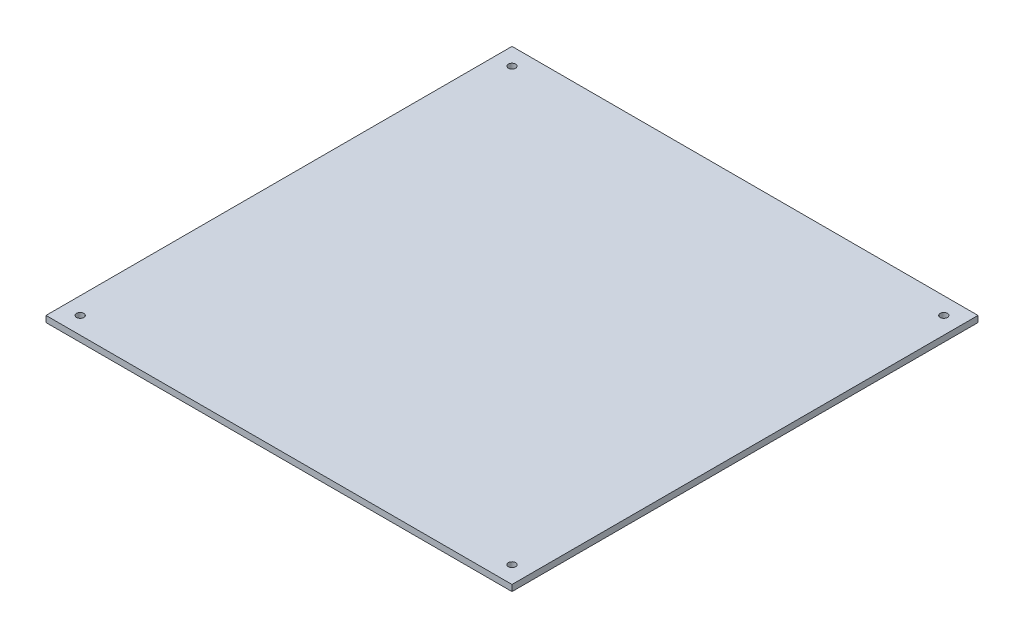
ISO-10303-21;
HEADER;
FILE_DESCRIPTION(('STEP AP214'),'2;1');
FILE_NAME('part.step','',(''),(''),'','','');
FILE_SCHEMA(('AUTOMOTIVE_DESIGN { 1 0 10303 214 1 1 1 1 }'));
ENDSEC;
DATA;
#1=APPLICATION_CONTEXT('core data for automotive mechanical design processes');
#2=APPLICATION_PROTOCOL_DEFINITION('international standard','automotive_design',2000,#1);
#3=PRODUCT_CONTEXT('',#1,'mechanical');
#4=PRODUCT('Part','Part','',(#3));
#5=PRODUCT_RELATED_PRODUCT_CATEGORY('part','',(#4));
#6=PRODUCT_DEFINITION_FORMATION('','',#4);
#7=PRODUCT_DEFINITION_CONTEXT('part definition',#1,'design');
#8=PRODUCT_DEFINITION('design','',#6,#7);
#9=PRODUCT_DEFINITION_SHAPE('','',#8);
#10=(LENGTH_UNIT() NAMED_UNIT(*) SI_UNIT(.MILLI.,.METRE.));
#11=(NAMED_UNIT(*) PLANE_ANGLE_UNIT() SI_UNIT($,.RADIAN.));
#12=(NAMED_UNIT(*) SI_UNIT($,.STERADIAN.) SOLID_ANGLE_UNIT());
#13=UNCERTAINTY_MEASURE_WITH_UNIT(LENGTH_MEASURE(1.E-05),#10,'distance_accuracy_value','');
#14=(GEOMETRIC_REPRESENTATION_CONTEXT(3) GLOBAL_UNCERTAINTY_ASSIGNED_CONTEXT((#13)) GLOBAL_UNIT_ASSIGNED_CONTEXT((#10,
#11,#12)) REPRESENTATION_CONTEXT('',''));
#15=CARTESIAN_POINT('',(0.,0.,0.));
#16=DIRECTION('',(0.,0.,1.));
#17=DIRECTION('',(1.,0.,0.));
#18=AXIS2_PLACEMENT_3D('',#15,#16,#17);
#19=CARTESIAN_POINT('',(0.,3.,0.));
#20=DIRECTION('',(1.,0.,0.));
#21=DIRECTION('',(0.,0.,-1.));
#22=AXIS2_PLACEMENT_3D('',#19,#20,#21);
#23=PLANE('',#22);
#24=DIRECTION('',(0.,0.,1.));
#25=VECTOR('',#24,1.);
#26=CARTESIAN_POINT('',(0.,0.,0.));
#27=LINE('',#26,#25);
#28=CARTESIAN_POINT('',(0.,0.,-225.));
#29=VERTEX_POINT('',#28);
#30=CARTESIAN_POINT('',(0.,0.,0.));
#31=VERTEX_POINT('',#30);
#32=EDGE_CURVE('E100',#29,#31,#27,.T.);
#33=ORIENTED_EDGE('',*,*,#32,.T.);
#34=DIRECTION('',(0.,-1.,0.));
#35=VECTOR('',#34,1.);
#36=CARTESIAN_POINT('',(0.,3.,0.));
#37=LINE('',#36,#35);
#38=CARTESIAN_POINT('',(0.,3.,0.));
#39=VERTEX_POINT('',#38);
#40=EDGE_CURVE('E11',#39,#31,#37,.T.);
#41=ORIENTED_EDGE('',*,*,#40,.F.);
#42=DIRECTION('',(0.,0.,1.));
#43=VECTOR('',#42,1.);
#44=CARTESIAN_POINT('',(0.,3.,0.));
#45=LINE('',#44,#43);
#46=CARTESIAN_POINT('',(0.,3.,-225.));
#47=VERTEX_POINT('',#46);
#48=EDGE_CURVE('E88',#47,#39,#45,.T.);
#49=ORIENTED_EDGE('',*,*,#48,.F.);
#50=DIRECTION('',(0.,-1.,0.));
#51=VECTOR('',#50,1.);
#52=CARTESIAN_POINT('',(0.,3.,-225.));
#53=LINE('',#52,#51);
#54=EDGE_CURVE('E96',#47,#29,#53,.T.);
#55=ORIENTED_EDGE('',*,*,#54,.T.);
#56=EDGE_LOOP('',(#33,#41,#49,#55));
#57=FACE_BOUND('',#56,.T.);
#58=ADVANCED_FACE('F37',(#57),#23,.F.);
#59=CARTESIAN_POINT('',(0.,3.,0.));
#60=DIRECTION('',(0.,0.,-1.));
#61=DIRECTION('',(-1.,0.,0.));
#62=AXIS2_PLACEMENT_3D('',#59,#60,#61);
#63=PLANE('',#62);
#64=DIRECTION('',(1.,0.,0.));
#65=VECTOR('',#64,1.);
#66=CARTESIAN_POINT('',(0.,0.,0.));
#67=LINE('',#66,#65);
#68=CARTESIAN_POINT('',(225.,0.,0.));
#69=VERTEX_POINT('',#68);
#70=EDGE_CURVE('E92',#31,#69,#67,.T.);
#71=ORIENTED_EDGE('',*,*,#70,.T.);
#72=DIRECTION('',(0.,-1.,0.));
#73=VECTOR('',#72,1.);
#74=CARTESIAN_POINT('',(225.,3.,0.));
#75=LINE('',#74,#73);
#76=CARTESIAN_POINT('',(225.,3.,0.));
#77=VERTEX_POINT('',#76);
#78=EDGE_CURVE('E45',#77,#69,#75,.T.);
#79=ORIENTED_EDGE('',*,*,#78,.F.);
#80=DIRECTION('',(1.,0.,0.));
#81=VECTOR('',#80,1.);
#82=CARTESIAN_POINT('',(0.,3.,0.));
#83=LINE('',#82,#81);
#84=EDGE_CURVE('E83',#39,#77,#83,.T.);
#85=ORIENTED_EDGE('',*,*,#84,.F.);
#86=ORIENTED_EDGE('',*,*,#40,.T.);
#87=EDGE_LOOP('',(#71,#79,#85,#86));
#88=FACE_BOUND('',#87,.T.);
#89=ADVANCED_FACE('F91',(#88),#63,.F.);
#90=CARTESIAN_POINT('',(225.,3.,0.));
#91=DIRECTION('',(-1.,0.,0.));
#92=DIRECTION('',(0.,0.,1.));
#93=AXIS2_PLACEMENT_3D('',#90,#91,#92);
#94=PLANE('',#93);
#95=DIRECTION('',(0.,0.,-1.));
#96=VECTOR('',#95,1.);
#97=CARTESIAN_POINT('',(225.,0.,0.));
#98=LINE('',#97,#96);
#99=CARTESIAN_POINT('',(225.,0.,-225.));
#100=VERTEX_POINT('',#99);
#101=EDGE_CURVE('E70',#69,#100,#98,.T.);
#102=ORIENTED_EDGE('',*,*,#101,.T.);
#103=DIRECTION('',(0.,-1.,0.));
#104=VECTOR('',#103,1.);
#105=CARTESIAN_POINT('',(225.,3.,-225.));
#106=LINE('',#105,#104);
#107=CARTESIAN_POINT('',(225.,3.,-225.));
#108=VERTEX_POINT('',#107);
#109=EDGE_CURVE('E93',#108,#100,#106,.T.);
#110=ORIENTED_EDGE('',*,*,#109,.F.);
#111=DIRECTION('',(0.,0.,-1.));
#112=VECTOR('',#111,1.);
#113=CARTESIAN_POINT('',(225.,3.,0.));
#114=LINE('',#113,#112);
#115=EDGE_CURVE('E86',#77,#108,#114,.T.);
#116=ORIENTED_EDGE('',*,*,#115,.F.);
#117=ORIENTED_EDGE('',*,*,#78,.T.);
#118=EDGE_LOOP('',(#102,#110,#116,#117));
#119=FACE_BOUND('',#118,.T.);
#120=ADVANCED_FACE('F94',(#119),#94,.F.);
#121=CARTESIAN_POINT('',(0.,3.,-225.));
#122=DIRECTION('',(0.,0.,1.));
#123=DIRECTION('',(1.,0.,0.));
#124=AXIS2_PLACEMENT_3D('',#121,#122,#123);
#125=PLANE('',#124);
#126=DIRECTION('',(-1.,0.,0.));
#127=VECTOR('',#126,1.);
#128=CARTESIAN_POINT('',(0.,0.,-225.));
#129=LINE('',#128,#127);
#130=EDGE_CURVE('E76',#100,#29,#129,.T.);
#131=ORIENTED_EDGE('',*,*,#130,.T.);
#132=ORIENTED_EDGE('',*,*,#54,.F.);
#133=DIRECTION('',(-1.,0.,0.));
#134=VECTOR('',#133,1.);
#135=CARTESIAN_POINT('',(0.,3.,-225.));
#136=LINE('',#135,#134);
#137=EDGE_CURVE('E53',#108,#47,#136,.T.);
#138=ORIENTED_EDGE('',*,*,#137,.F.);
#139=ORIENTED_EDGE('',*,*,#109,.T.);
#140=EDGE_LOOP('',(#131,#132,#138,#139));
#141=FACE_BOUND('',#140,.T.);
#142=ADVANCED_FACE('F108',(#141),#125,.F.);
#143=CARTESIAN_POINT('',(0.,3.,0.));
#144=DIRECTION('',(0.,-1.,0.));
#145=DIRECTION('',(0.,0.,-1.));
#146=AXIS2_PLACEMENT_3D('',#143,#144,#145);
#147=PLANE('',#146);
#148=CARTESIAN_POINT('',(8.25999999999999,3.,-216.74));
#149=DIRECTION('',(0.,1.,0.));
#150=DIRECTION('',(0.,0.,-1.));
#151=AXIS2_PLACEMENT_3D('',#148,#149,#150);
#152=CIRCLE('',#151,1.75000000000001);
#153=CARTESIAN_POINT('',(8.25999999999999,3.,-218.49));
#154=VERTEX_POINT('',#153);
#155=EDGE_CURVE('E127',#154,#154,#152,.T.);
#156=ORIENTED_EDGE('',*,*,#155,.F.);
#157=EDGE_LOOP('',(#156));
#158=FACE_BOUND('',#157,.T.);
#159=CARTESIAN_POINT('',(216.74,3.,-8.26000000000002));
#160=DIRECTION('',(0.,1.,0.));
#161=DIRECTION('',(0.,0.,-1.));
#162=AXIS2_PLACEMENT_3D('',#159,#160,#161);
#163=CIRCLE('',#162,1.75000000000001);
#164=CARTESIAN_POINT('',(216.74,3.,-10.01));
#165=VERTEX_POINT('',#164);
#166=EDGE_CURVE('E120',#165,#165,#163,.T.);
#167=ORIENTED_EDGE('',*,*,#166,.F.);
#168=EDGE_LOOP('',(#167));
#169=FACE_BOUND('',#168,.T.);
#170=CARTESIAN_POINT('',(8.26000000000002,3.,-8.25999999999996));
#171=DIRECTION('',(0.,1.,0.));
#172=DIRECTION('',(0.,0.,1.));
#173=AXIS2_PLACEMENT_3D('',#170,#171,#172);
#174=CIRCLE('',#173,1.75000000000001);
#175=CARTESIAN_POINT('',(8.26000000000002,3.,-6.50999999999995));
#176=VERTEX_POINT('',#175);
#177=EDGE_CURVE('E132',#176,#176,#174,.T.);
#178=ORIENTED_EDGE('',*,*,#177,.F.);
#179=EDGE_LOOP('',(#178));
#180=FACE_BOUND('',#179,.T.);
#181=CARTESIAN_POINT('',(216.74,3.,-216.74));
#182=DIRECTION('',(0.,1.,0.));
#183=DIRECTION('',(0.,0.,1.));
#184=AXIS2_PLACEMENT_3D('',#181,#182,#183);
#185=CIRCLE('',#184,1.75000000000001);
#186=CARTESIAN_POINT('',(216.74,3.,-214.99));
#187=VERTEX_POINT('',#186);
#188=EDGE_CURVE('E114',#187,#187,#185,.T.);
#189=ORIENTED_EDGE('',*,*,#188,.F.);
#190=EDGE_LOOP('',(#189));
#191=FACE_BOUND('',#190,.T.);
#192=ORIENTED_EDGE('',*,*,#48,.T.);
#193=ORIENTED_EDGE('',*,*,#84,.T.);
#194=ORIENTED_EDGE('',*,*,#115,.T.);
#195=ORIENTED_EDGE('',*,*,#137,.T.);
#196=EDGE_LOOP('',(#192,#193,#194,#195));
#197=FACE_BOUND('',#196,.T.);
#198=ADVANCED_FACE('F84',(#158,#169,#180,#191,#197),#147,.F.);
#199=CARTESIAN_POINT('',(0.,0.,0.));
#200=DIRECTION('',(0.,-1.,0.));
#201=DIRECTION('',(0.,0.,-1.));
#202=AXIS2_PLACEMENT_3D('',#199,#200,#201);
#203=PLANE('',#202);
#204=CARTESIAN_POINT('',(8.25999999999999,0.,-216.74));
#205=DIRECTION('',(0.,1.,0.));
#206=DIRECTION('',(0.,0.,-1.));
#207=AXIS2_PLACEMENT_3D('',#204,#205,#206);
#208=CIRCLE('',#207,1.75000000000001);
#209=CARTESIAN_POINT('',(8.25999999999999,0.,-218.49));
#210=VERTEX_POINT('',#209);
#211=EDGE_CURVE('E117',#210,#210,#208,.T.);
#212=ORIENTED_EDGE('',*,*,#211,.T.);
#213=EDGE_LOOP('',(#212));
#214=FACE_BOUND('',#213,.T.);
#215=CARTESIAN_POINT('',(216.74,0.,-8.26000000000002));
#216=DIRECTION('',(0.,1.,0.));
#217=DIRECTION('',(0.,0.,-1.));
#218=AXIS2_PLACEMENT_3D('',#215,#216,#217);
#219=CIRCLE('',#218,1.75000000000001);
#220=CARTESIAN_POINT('',(216.74,0.,-10.01));
#221=VERTEX_POINT('',#220);
#222=EDGE_CURVE('E123',#221,#221,#219,.T.);
#223=ORIENTED_EDGE('',*,*,#222,.T.);
#224=EDGE_LOOP('',(#223));
#225=FACE_BOUND('',#224,.T.);
#226=CARTESIAN_POINT('',(8.26000000000002,0.,-8.25999999999996));
#227=DIRECTION('',(0.,1.,0.));
#228=DIRECTION('',(0.,0.,1.));
#229=AXIS2_PLACEMENT_3D('',#226,#227,#228);
#230=CIRCLE('',#229,1.75000000000001);
#231=CARTESIAN_POINT('',(8.26000000000002,0.,-6.50999999999995));
#232=VERTEX_POINT('',#231);
#233=EDGE_CURVE('E124',#232,#232,#230,.T.);
#234=ORIENTED_EDGE('',*,*,#233,.T.);
#235=EDGE_LOOP('',(#234));
#236=FACE_BOUND('',#235,.T.);
#237=CARTESIAN_POINT('',(216.74,0.,-216.74));
#238=DIRECTION('',(0.,1.,0.));
#239=DIRECTION('',(0.,0.,1.));
#240=AXIS2_PLACEMENT_3D('',#237,#238,#239);
#241=CIRCLE('',#240,1.75000000000001);
#242=CARTESIAN_POINT('',(216.74,0.,-214.99));
#243=VERTEX_POINT('',#242);
#244=EDGE_CURVE('E103',#243,#243,#241,.T.);
#245=ORIENTED_EDGE('',*,*,#244,.T.);
#246=EDGE_LOOP('',(#245));
#247=FACE_BOUND('',#246,.T.);
#248=ORIENTED_EDGE('',*,*,#32,.F.);
#249=ORIENTED_EDGE('',*,*,#130,.F.);
#250=ORIENTED_EDGE('',*,*,#101,.F.);
#251=ORIENTED_EDGE('',*,*,#70,.F.);
#252=EDGE_LOOP('',(#248,#249,#250,#251));
#253=FACE_BOUND('',#252,.T.);
#254=ADVANCED_FACE('F111',(#214,#225,#236,#247,#253),#203,.T.);
#255=CARTESIAN_POINT('',(216.74,0.,-216.74));
#256=DIRECTION('',(0.,1.,0.));
#257=DIRECTION('',(0.,0.,1.));
#258=AXIS2_PLACEMENT_3D('',#255,#256,#257);
#259=CYLINDRICAL_SURFACE('',#258,1.75000000000001);
#260=ORIENTED_EDGE('',*,*,#244,.F.);
#261=EDGE_LOOP('',(#260));
#262=FACE_BOUND('',#261,.T.);
#263=ORIENTED_EDGE('',*,*,#188,.T.);
#264=EDGE_LOOP('',(#263));
#265=FACE_BOUND('',#264,.T.);
#266=ADVANCED_FACE('F144',(#262,#265),#259,.F.);
#267=CARTESIAN_POINT('',(8.26000000000002,0.,-8.25999999999996));
#268=DIRECTION('',(0.,1.,0.));
#269=DIRECTION('',(0.,0.,1.));
#270=AXIS2_PLACEMENT_3D('',#267,#268,#269);
#271=CYLINDRICAL_SURFACE('',#270,1.75000000000001);
#272=ORIENTED_EDGE('',*,*,#233,.F.);
#273=EDGE_LOOP('',(#272));
#274=FACE_BOUND('',#273,.T.);
#275=ORIENTED_EDGE('',*,*,#177,.T.);
#276=EDGE_LOOP('',(#275));
#277=FACE_BOUND('',#276,.T.);
#278=ADVANCED_FACE('F140',(#274,#277),#271,.F.);
#279=CARTESIAN_POINT('',(216.74,0.,-8.26000000000002));
#280=DIRECTION('',(0.,1.,0.));
#281=DIRECTION('',(0.,0.,1.));
#282=AXIS2_PLACEMENT_3D('',#279,#280,#281);
#283=CYLINDRICAL_SURFACE('',#282,1.75000000000001);
#284=ORIENTED_EDGE('',*,*,#222,.F.);
#285=EDGE_LOOP('',(#284));
#286=FACE_BOUND('',#285,.T.);
#287=ORIENTED_EDGE('',*,*,#166,.T.);
#288=EDGE_LOOP('',(#287));
#289=FACE_BOUND('',#288,.T.);
#290=ADVANCED_FACE('F143',(#286,#289),#283,.F.);
#291=CARTESIAN_POINT('',(8.25999999999999,0.,-216.74));
#292=DIRECTION('',(0.,1.,0.));
#293=DIRECTION('',(0.,0.,1.));
#294=AXIS2_PLACEMENT_3D('',#291,#292,#293);
#295=CYLINDRICAL_SURFACE('',#294,1.75000000000001);
#296=ORIENTED_EDGE('',*,*,#211,.F.);
#297=EDGE_LOOP('',(#296));
#298=FACE_BOUND('',#297,.T.);
#299=ORIENTED_EDGE('',*,*,#155,.T.);
#300=EDGE_LOOP('',(#299));
#301=FACE_BOUND('',#300,.T.);
#302=ADVANCED_FACE('F205',(#298,#301),#295,.F.);
#303=CLOSED_SHELL('',(#58,#89,#120,#142,#198,#254,#266,#278,#290,#302));
#304=MANIFOLD_SOLID_BREP('B2',#303);
#305=ADVANCED_BREP_SHAPE_REPRESENTATION('',(#18,#304),#14);
#306=SHAPE_DEFINITION_REPRESENTATION(#9,#305);
ENDSEC;
END-ISO-10303-21;
